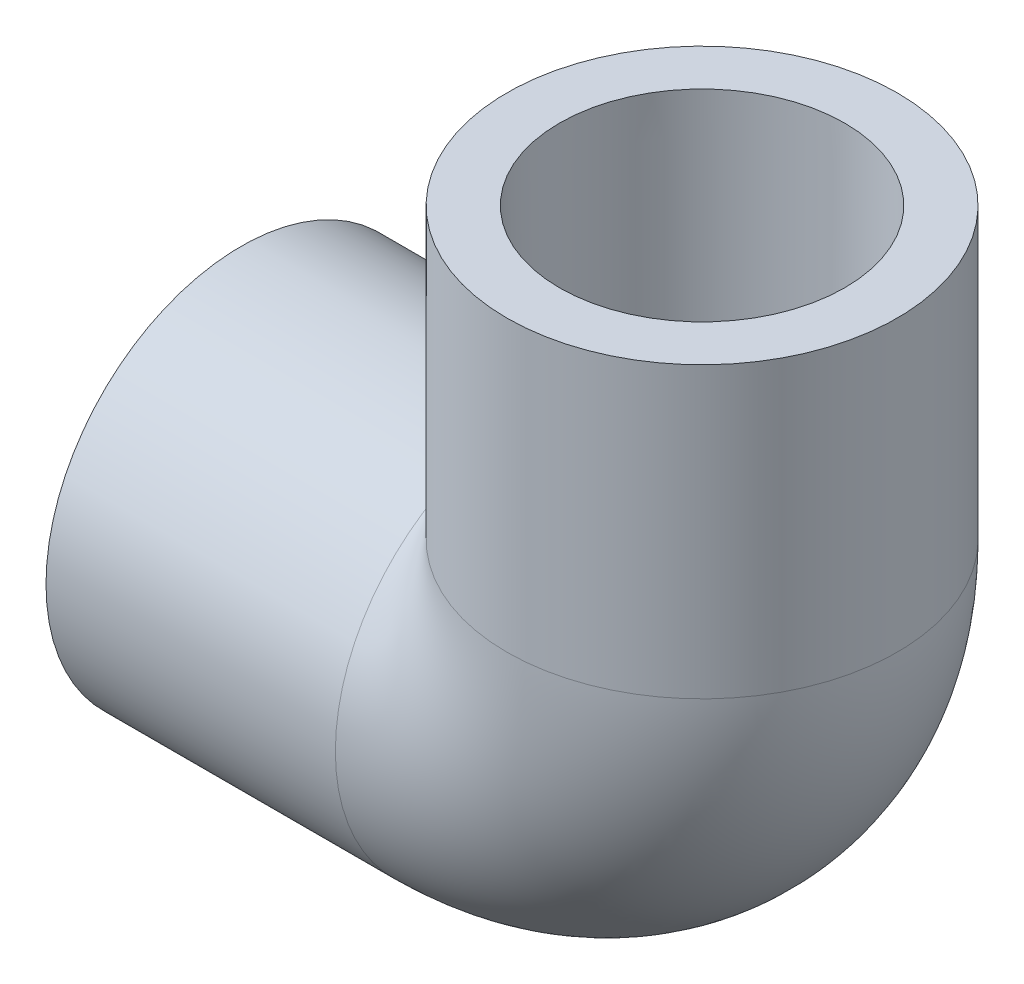
ISO-10303-21;
HEADER;
FILE_DESCRIPTION(('STEP AP214'),'2;1');
FILE_NAME('part.step','',(''),(''),'','','');
FILE_SCHEMA(('AUTOMOTIVE_DESIGN { 1 0 10303 214 1 1 1 1 }'));
ENDSEC;
DATA;
#1=APPLICATION_CONTEXT('core data for automotive mechanical design processes');
#2=APPLICATION_PROTOCOL_DEFINITION('international standard','automotive_design',2000,#1);
#3=PRODUCT_CONTEXT('',#1,'mechanical');
#4=PRODUCT('Part','Part','',(#3));
#5=PRODUCT_RELATED_PRODUCT_CATEGORY('part','',(#4));
#6=PRODUCT_DEFINITION_FORMATION('','',#4);
#7=PRODUCT_DEFINITION_CONTEXT('part definition',#1,'design');
#8=PRODUCT_DEFINITION('design','',#6,#7);
#9=PRODUCT_DEFINITION_SHAPE('','',#8);
#10=(LENGTH_UNIT() NAMED_UNIT(*) SI_UNIT(.MILLI.,.METRE.));
#11=(NAMED_UNIT(*) PLANE_ANGLE_UNIT() SI_UNIT($,.RADIAN.));
#12=(NAMED_UNIT(*) SI_UNIT($,.STERADIAN.) SOLID_ANGLE_UNIT());
#13=UNCERTAINTY_MEASURE_WITH_UNIT(LENGTH_MEASURE(1.E-05),#10,'distance_accuracy_value','');
#14=(GEOMETRIC_REPRESENTATION_CONTEXT(3) GLOBAL_UNCERTAINTY_ASSIGNED_CONTEXT((#13)) GLOBAL_UNIT_ASSIGNED_CONTEXT((#10,
#11,#12)) REPRESENTATION_CONTEXT('',''));
#15=CARTESIAN_POINT('',(0.,0.,0.));
#16=DIRECTION('',(0.,0.,1.));
#17=DIRECTION('',(1.,0.,0.));
#18=AXIS2_PLACEMENT_3D('',#15,#16,#17);
#19=CARTESIAN_POINT('',(-34.798,-14.732,0.));
#20=DIRECTION('',(-1.,0.,0.));
#21=DIRECTION('',(0.,0.,1.));
#22=AXIS2_PLACEMENT_3D('',#19,#20,#21);
#23=PLANE('',#22);
#24=CARTESIAN_POINT('',(-34.798,0.,0.));
#25=DIRECTION('',(-1.,0.,0.));
#26=DIRECTION('',(0.,0.,1.));
#27=AXIS2_PLACEMENT_3D('',#24,#25,#26);
#28=CIRCLE('',#27,14.732);
#29=CARTESIAN_POINT('',(-34.798,0.,14.732));
#30=VERTEX_POINT('',#29);
#31=EDGE_CURVE('E61',#30,#30,#28,.T.);
#32=ORIENTED_EDGE('',*,*,#31,.T.);
#33=EDGE_LOOP('',(#32));
#34=FACE_BOUND('',#33,.T.);
#35=CARTESIAN_POINT('',(-34.798,0.,0.));
#36=DIRECTION('',(-1.,0.,0.));
#37=DIRECTION('',(0.,0.,1.));
#38=AXIS2_PLACEMENT_3D('',#35,#36,#37);
#39=CIRCLE('',#38,10.7696);
#40=CARTESIAN_POINT('',(-34.798,0.,10.7696));
#41=VERTEX_POINT('',#40);
#42=EDGE_CURVE('E47',#41,#41,#39,.T.);
#43=ORIENTED_EDGE('',*,*,#42,.F.);
#44=EDGE_LOOP('',(#43));
#45=FACE_BOUND('',#44,.T.);
#46=ADVANCED_FACE('F39',(#34,#45),#23,.T.);
#47=CARTESIAN_POINT('',(-12.954,0.,0.));
#48=DIRECTION('',(-1.,0.,0.));
#49=DIRECTION('',(0.,0.,1.));
#50=AXIS2_PLACEMENT_3D('',#47,#48,#49);
#51=CONICAL_SURFACE('',#50,10.6172,0.0069766309917721);
#52=ORIENTED_EDGE('',*,*,#42,.T.);
#53=EDGE_LOOP('',(#52));
#54=FACE_BOUND('',#53,.T.);
#55=CARTESIAN_POINT('',(-12.954,0.,0.));
#56=DIRECTION('',(-1.,0.,0.));
#57=DIRECTION('',(0.,0.,1.));
#58=AXIS2_PLACEMENT_3D('',#55,#56,#57);
#59=CIRCLE('',#58,10.6172);
#60=CARTESIAN_POINT('',(-12.954,0.,10.6172));
#61=VERTEX_POINT('',#60);
#62=EDGE_CURVE('E74',#61,#61,#59,.T.);
#63=ORIENTED_EDGE('',*,*,#62,.F.);
#64=EDGE_LOOP('',(#63));
#65=FACE_BOUND('',#64,.T.);
#66=ADVANCED_FACE('F86',(#54,#65),#51,.F.);
#67=CARTESIAN_POINT('',(-34.798,0.,0.));
#68=DIRECTION('',(-1.,0.,0.));
#69=DIRECTION('',(0.,0.,1.));
#70=AXIS2_PLACEMENT_3D('',#67,#68,#69);
#71=CYLINDRICAL_SURFACE('',#70,14.732);
#72=CARTESIAN_POINT('',(0.,0.,0.));
#73=DIRECTION('',(-0.707106781186547,-0.707106781186547,0.));
#74=DIRECTION('',(-0.707106781186547,0.707106781186547,0.));
#75=AXIS2_PLACEMENT_3D('',#72,#73,#74);
#76=ELLIPSE('',#75,20.8341942008804,14.732);
#77=CARTESIAN_POINT('',(-12.954,12.954,-7.01610347700203));
#78=VERTEX_POINT('',#77);
#79=CARTESIAN_POINT('',(-12.954,12.954,7.01610347700202));
#80=VERTEX_POINT('',#79);
#81=EDGE_CURVE('E59',#78,#80,#76,.F.);
#82=ORIENTED_EDGE('',*,*,#81,.F.);
#83=CARTESIAN_POINT('',(-12.954,0.,0.));
#84=DIRECTION('',(-1.,0.,0.));
#85=DIRECTION('',(0.,0.,1.));
#86=AXIS2_PLACEMENT_3D('',#83,#84,#85);
#87=CIRCLE('',#86,14.732);
#88=EDGE_CURVE('E67',#78,#80,#87,.T.);
#89=ORIENTED_EDGE('',*,*,#88,.T.);
#90=EDGE_LOOP('',(#82,#89));
#91=FACE_BOUND('',#90,.T.);
#92=ORIENTED_EDGE('',*,*,#31,.F.);
#93=EDGE_LOOP('',(#92));
#94=FACE_BOUND('',#93,.T.);
#95=ADVANCED_FACE('F65',(#91,#94),#71,.T.);
#96=CARTESIAN_POINT('',(-12.954,12.954,0.));
#97=DIRECTION('',(0.,0.,-1.));
#98=DIRECTION('',(-1.,0.,0.));
#99=AXIS2_PLACEMENT_3D('',#96,#97,#98);
#100=TOROIDAL_SURFACE('',#99,12.954,6.9342);
#101=CARTESIAN_POINT('',(0.,12.954,0.));
#102=DIRECTION('',(0.,1.,0.));
#103=DIRECTION('',(0.,0.,-1.));
#104=AXIS2_PLACEMENT_3D('',#101,#102,#103);
#105=CIRCLE('',#104,6.9342);
#106=CARTESIAN_POINT('',(6.9342,12.954,0.));
#107=VERTEX_POINT('',#106);
#108=EDGE_CURVE('E62',#107,#107,#105,.T.);
#109=CARTESIAN_POINT('',(-12.954,0.,0.));
#110=DIRECTION('',(1.,0.,0.));
#111=DIRECTION('',(0.,0.,-1.));
#112=AXIS2_PLACEMENT_3D('',#109,#110,#111);
#113=CIRCLE('',#112,6.9342);
#114=CARTESIAN_POINT('',(-12.954,-6.9342,0.));
#115=VERTEX_POINT('',#114);
#116=EDGE_CURVE('E69',#115,#115,#113,.T.);
#117=CARTESIAN_POINT('',(-12.954,12.954,0.));
#118=DIRECTION('',(0.,0.,-1.));
#119=DIRECTION('',(-1.,0.,0.));
#120=AXIS2_PLACEMENT_3D('',#117,#118,#119);
#121=CIRCLE('',#120,19.8882);
#122=EDGE_CURVE('',#107,#115,#121,.T.);
#123=ORIENTED_EDGE('',*,*,#108,.T.);
#124=ORIENTED_EDGE('',*,*,#116,.F.);
#125=ORIENTED_EDGE('',*,*,#122,.T.);
#126=ORIENTED_EDGE('',*,*,#122,.F.);
#127=EDGE_LOOP('',(#123,#125,#124,#126));
#128=FACE_BOUND('',#127,.T.);
#129=ADVANCED_FACE('F96',(#128),#100,.F.);
#130=CARTESIAN_POINT('',(-25.908,12.954,0.));
#131=DIRECTION('',(0.,-1.,0.));
#132=DIRECTION('',(-1.,0.,0.));
#133=AXIS2_PLACEMENT_3D('',#130,#131,#132);
#134=CIRCLE('',#133,14.732);
#135=TRIMMED_CURVE('',#134,(PARAMETER_VALUE(-2.64520848846067)),
(PARAMETER_VALUE(2.64520848846067)),.T.,.PARAMETER.);
#136=CARTESIAN_POINT('',(-12.954,12.954,0.));
#137=DIRECTION('',(0.,0.,-1.));
#138=AXIS1_PLACEMENT('',#136,#137);
#139=SURFACE_OF_REVOLUTION('',#135,#138);
#140=CARTESIAN_POINT('',(0.,12.954,0.));
#141=DIRECTION('',(0.,1.,0.));
#142=DIRECTION('',(0.,0.,-1.));
#143=AXIS2_PLACEMENT_3D('',#140,#141,#142);
#144=CIRCLE('',#143,14.732);
#145=EDGE_CURVE('E53',#80,#78,#144,.T.);
#146=ORIENTED_EDGE('',*,*,#145,.F.);
#147=ORIENTED_EDGE('',*,*,#88,.F.);
#148=EDGE_LOOP('',(#146,#147));
#149=FACE_BOUND('',#148,.T.);
#150=ADVANCED_FACE('F72',(#149),#139,.T.);
#151=CARTESIAN_POINT('',(0.,12.954,0.));
#152=DIRECTION('',(0.,1.,0.));
#153=DIRECTION('',(0.,0.,-1.));
#154=AXIS2_PLACEMENT_3D('',#151,#152,#153);
#155=PLANE('',#154);
#156=CARTESIAN_POINT('',(0.,12.954,0.));
#157=DIRECTION('',(0.,1.,0.));
#158=DIRECTION('',(-1.,0.,0.));
#159=AXIS2_PLACEMENT_3D('',#156,#157,#158);
#160=CIRCLE('',#159,10.6172);
#161=CARTESIAN_POINT('',(-10.6172,12.954,0.));
#162=VERTEX_POINT('',#161);
#163=EDGE_CURVE('E11',#162,#162,#160,.F.);
#164=ORIENTED_EDGE('',*,*,#163,.F.);
#165=EDGE_LOOP('',(#164));
#166=FACE_BOUND('',#165,.T.);
#167=ORIENTED_EDGE('',*,*,#108,.F.);
#168=EDGE_LOOP('',(#167));
#169=FACE_BOUND('',#168,.T.);
#170=ADVANCED_FACE('F105',(#166,#169),#155,.T.);
#171=CARTESIAN_POINT('',(-12.954,0.,0.));
#172=DIRECTION('',(1.,0.,0.));
#173=DIRECTION('',(0.,0.,-1.));
#174=AXIS2_PLACEMENT_3D('',#171,#172,#173);
#175=PLANE('',#174);
#176=ORIENTED_EDGE('',*,*,#62,.T.);
#177=EDGE_LOOP('',(#176));
#178=FACE_BOUND('',#177,.T.);
#179=ORIENTED_EDGE('',*,*,#116,.T.);
#180=EDGE_LOOP('',(#179));
#181=FACE_BOUND('',#180,.T.);
#182=ADVANCED_FACE('F109',(#178,#181),#175,.F.);
#183=CARTESIAN_POINT('',(14.732,34.798,0.));
#184=DIRECTION('',(0.,1.,0.));
#185=DIRECTION('',(0.,0.,1.));
#186=AXIS2_PLACEMENT_3D('',#183,#184,#185);
#187=PLANE('',#186);
#188=CARTESIAN_POINT('',(0.,34.798,0.));
#189=DIRECTION('',(0.,-1.,0.));
#190=DIRECTION('',(0.,0.,-1.));
#191=AXIS2_PLACEMENT_3D('',#188,#189,#190);
#192=CIRCLE('',#191,10.7696);
#193=CARTESIAN_POINT('',(0.,34.798,-10.7696));
#194=VERTEX_POINT('',#193);
#195=EDGE_CURVE('E130',#194,#194,#192,.T.);
#196=ORIENTED_EDGE('',*,*,#195,.T.);
#197=EDGE_LOOP('',(#196));
#198=FACE_BOUND('',#197,.T.);
#199=CARTESIAN_POINT('',(0.,34.798,0.));
#200=DIRECTION('',(0.,-1.,0.));
#201=DIRECTION('',(0.,0.,-1.));
#202=AXIS2_PLACEMENT_3D('',#199,#200,#201);
#203=CIRCLE('',#202,14.732);
#204=CARTESIAN_POINT('',(0.,34.798,-14.732));
#205=VERTEX_POINT('',#204);
#206=EDGE_CURVE('E70',#205,#205,#203,.T.);
#207=ORIENTED_EDGE('',*,*,#206,.F.);
#208=EDGE_LOOP('',(#207));
#209=FACE_BOUND('',#208,.T.);
#210=ADVANCED_FACE('F113',(#198,#209),#187,.T.);
#211=CARTESIAN_POINT('',(0.,0.,0.));
#212=DIRECTION('',(0.,-1.,0.));
#213=DIRECTION('',(0.,0.,-1.));
#214=AXIS2_PLACEMENT_3D('',#211,#212,#213);
#215=CYLINDRICAL_SURFACE('',#214,14.732);
#216=ORIENTED_EDGE('',*,*,#206,.T.);
#217=EDGE_LOOP('',(#216));
#218=FACE_BOUND('',#217,.T.);
#219=ORIENTED_EDGE('',*,*,#145,.T.);
#220=ORIENTED_EDGE('',*,*,#81,.T.);
#221=EDGE_LOOP('',(#219,#220));
#222=FACE_BOUND('',#221,.T.);
#223=ADVANCED_FACE('F58',(#218,#222),#215,.T.);
#224=CARTESIAN_POINT('',(0.,34.798,0.));
#225=DIRECTION('',(0.,1.,0.));
#226=DIRECTION('',(0.,0.,1.));
#227=AXIS2_PLACEMENT_3D('',#224,#225,#226);
#228=CONICAL_SURFACE('',#227,10.7696,0.0069766309917721);
#229=ORIENTED_EDGE('',*,*,#163,.T.);
#230=EDGE_LOOP('',(#229));
#231=FACE_BOUND('',#230,.T.);
#232=ORIENTED_EDGE('',*,*,#195,.F.);
#233=EDGE_LOOP('',(#232));
#234=FACE_BOUND('',#233,.T.);
#235=ADVANCED_FACE('F120',(#231,#234),#228,.F.);
#236=CLOSED_SHELL('',(#46,#66,#95,#129,#150,#170,#182,#210,#223,#235));
#237=MANIFOLD_SOLID_BREP('B2',#236);
#238=ADVANCED_BREP_SHAPE_REPRESENTATION('',(#18,#237),#14);
#239=SHAPE_DEFINITION_REPRESENTATION(#9,#238);
ENDSEC;
END-ISO-10303-21;
